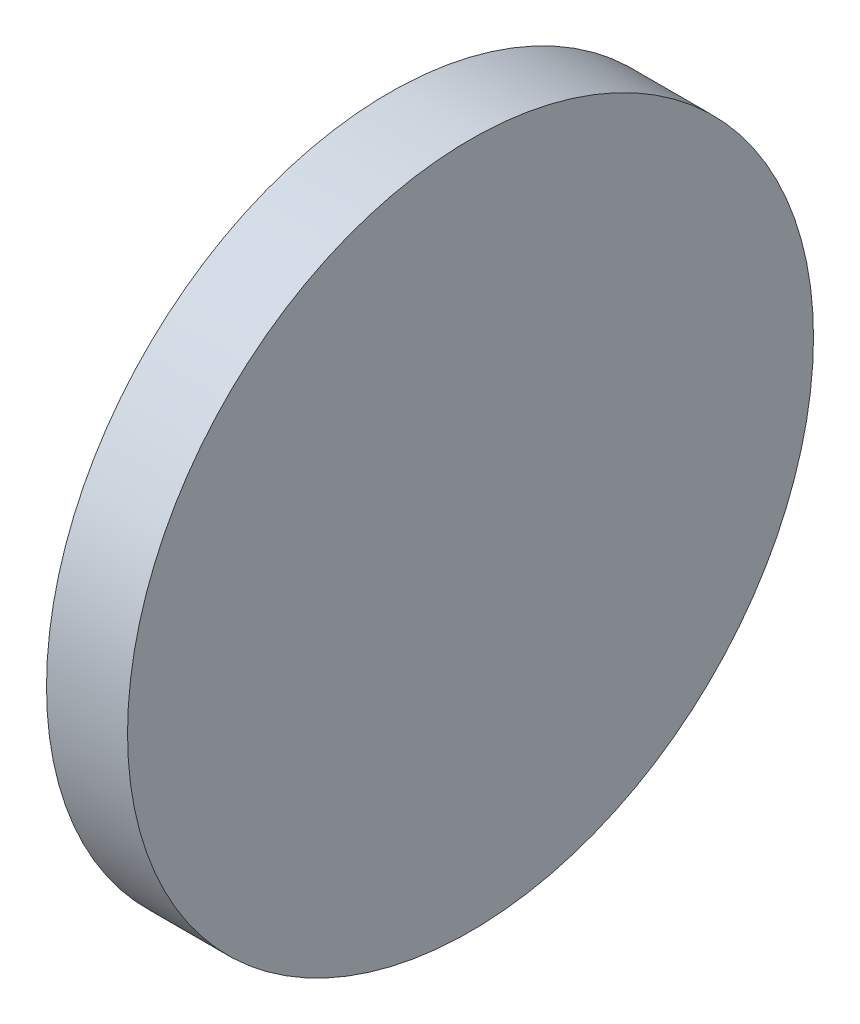
ISO-10303-21;
HEADER;
FILE_DESCRIPTION(('STEP AP214'),'2;1');
FILE_NAME('part.step','',(''),(''),'','','');
FILE_SCHEMA(('AUTOMOTIVE_DESIGN { 1 0 10303 214 1 1 1 1 }'));
ENDSEC;
DATA;
#1=APPLICATION_CONTEXT('core data for automotive mechanical design processes');
#2=APPLICATION_PROTOCOL_DEFINITION('international standard','automotive_design',2000,#1);
#3=PRODUCT_CONTEXT('',#1,'mechanical');
#4=PRODUCT('Part','Part','',(#3));
#5=PRODUCT_RELATED_PRODUCT_CATEGORY('part','',(#4));
#6=PRODUCT_DEFINITION_FORMATION('','',#4);
#7=PRODUCT_DEFINITION_CONTEXT('part definition',#1,'design');
#8=PRODUCT_DEFINITION('design','',#6,#7);
#9=PRODUCT_DEFINITION_SHAPE('','',#8);
#10=(LENGTH_UNIT() NAMED_UNIT(*) SI_UNIT(.MILLI.,.METRE.));
#11=(NAMED_UNIT(*) PLANE_ANGLE_UNIT() SI_UNIT($,.RADIAN.));
#12=(NAMED_UNIT(*) SI_UNIT($,.STERADIAN.) SOLID_ANGLE_UNIT());
#13=UNCERTAINTY_MEASURE_WITH_UNIT(LENGTH_MEASURE(1.E-05),#10,'distance_accuracy_value','');
#14=(GEOMETRIC_REPRESENTATION_CONTEXT(3) GLOBAL_UNCERTAINTY_ASSIGNED_CONTEXT((#13)) GLOBAL_UNIT_ASSIGNED_CONTEXT((#10,
#11,#12)) REPRESENTATION_CONTEXT('',''));
#15=CARTESIAN_POINT('',(0.,0.,0.));
#16=DIRECTION('',(0.,0.,1.));
#17=DIRECTION('',(1.,0.,0.));
#18=AXIS2_PLACEMENT_3D('',#15,#16,#17);
#19=CARTESIAN_POINT('',(3.,19.05,0.));
#20=DIRECTION('',(-1.,0.,0.));
#21=DIRECTION('',(0.,0.,1.));
#22=AXIS2_PLACEMENT_3D('',#19,#20,#21);
#23=PLANE('',#22);
#24=CARTESIAN_POINT('',(3.,0.,0.));
#25=DIRECTION('',(-1.,0.,0.));
#26=DIRECTION('',(0.,0.,1.));
#27=AXIS2_PLACEMENT_3D('',#24,#25,#26);
#28=CIRCLE('',#27,25.4);
#29=CARTESIAN_POINT('',(3.,0.,25.4));
#30=VERTEX_POINT('',#29);
#31=EDGE_CURVE('E44',#30,#30,#28,.T.);
#32=ORIENTED_EDGE('',*,*,#31,.F.);
#33=EDGE_LOOP('',(#32));
#34=FACE_BOUND('',#33,.T.);
#35=ADVANCED_FACE('F37',(#34),#23,.F.);
#36=CARTESIAN_POINT('',(-1.61421241885762,0.,0.));
#37=DIRECTION('',(-1.,0.,0.));
#38=DIRECTION('',(0.,0.,1.));
#39=AXIS2_PLACEMENT_3D('',#36,#37,#38);
#40=CYLINDRICAL_SURFACE('',#39,25.4);
#41=CARTESIAN_POINT('',(-3.,0.,0.));
#42=DIRECTION('',(-1.,0.,0.));
#43=DIRECTION('',(0.,0.,1.));
#44=AXIS2_PLACEMENT_3D('',#41,#42,#43);
#45=CIRCLE('',#44,25.4);
#46=CARTESIAN_POINT('',(-3.,0.,25.4));
#47=VERTEX_POINT('',#46);
#48=EDGE_CURVE('E10',#47,#47,#45,.T.);
#49=ORIENTED_EDGE('',*,*,#48,.F.);
#50=EDGE_LOOP('',(#49));
#51=FACE_BOUND('',#50,.T.);
#52=ORIENTED_EDGE('',*,*,#31,.T.);
#53=EDGE_LOOP('',(#52));
#54=FACE_BOUND('',#53,.T.);
#55=ADVANCED_FACE('F51',(#51,#54),#40,.T.);
#56=CARTESIAN_POINT('',(-3.,19.05,0.));
#57=DIRECTION('',(1.,0.,0.));
#58=DIRECTION('',(0.,0.,-1.));
#59=AXIS2_PLACEMENT_3D('',#56,#57,#58);
#60=PLANE('',#59);
#61=ORIENTED_EDGE('',*,*,#48,.T.);
#62=EDGE_LOOP('',(#61));
#63=FACE_BOUND('',#62,.T.);
#64=ADVANCED_FACE('F57',(#63),#60,.F.);
#65=CLOSED_SHELL('',(#35,#55,#64));
#66=MANIFOLD_SOLID_BREP('B2',#65);
#67=ADVANCED_BREP_SHAPE_REPRESENTATION('',(#18,#66),#14);
#68=SHAPE_DEFINITION_REPRESENTATION(#9,#67);
ENDSEC;
END-ISO-10303-21;
